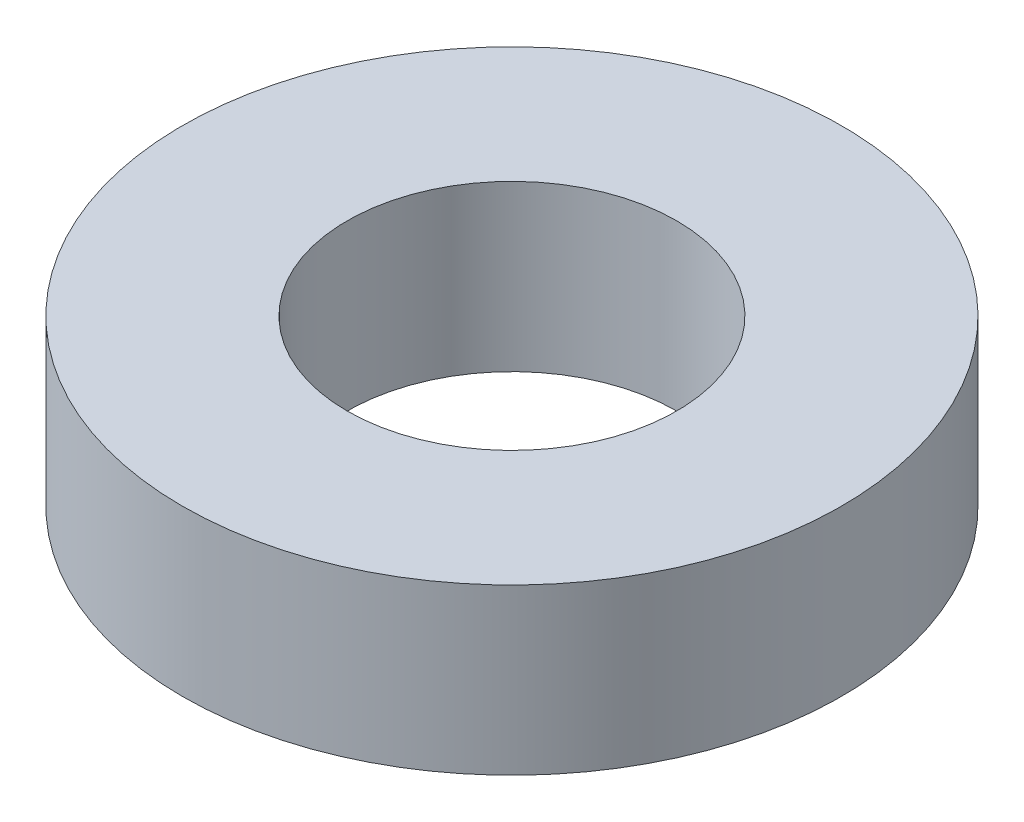
ISO-10303-21;
HEADER;
FILE_DESCRIPTION(('STEP AP214'),'2;1');
FILE_NAME('part.step','',(''),(''),'','','');
FILE_SCHEMA(('AUTOMOTIVE_DESIGN { 1 0 10303 214 1 1 1 1 }'));
ENDSEC;
DATA;
#1=APPLICATION_CONTEXT('core data for automotive mechanical design processes');
#2=APPLICATION_PROTOCOL_DEFINITION('international standard','automotive_design',2000,#1);
#3=PRODUCT_CONTEXT('',#1,'mechanical');
#4=PRODUCT('Part','Part','',(#3));
#5=PRODUCT_RELATED_PRODUCT_CATEGORY('part','',(#4));
#6=PRODUCT_DEFINITION_FORMATION('','',#4);
#7=PRODUCT_DEFINITION_CONTEXT('part definition',#1,'design');
#8=PRODUCT_DEFINITION('design','',#6,#7);
#9=PRODUCT_DEFINITION_SHAPE('','',#8);
#10=(LENGTH_UNIT() NAMED_UNIT(*) SI_UNIT(.MILLI.,.METRE.));
#11=(NAMED_UNIT(*) PLANE_ANGLE_UNIT() SI_UNIT($,.RADIAN.));
#12=(NAMED_UNIT(*) SI_UNIT($,.STERADIAN.) SOLID_ANGLE_UNIT());
#13=UNCERTAINTY_MEASURE_WITH_UNIT(LENGTH_MEASURE(1.E-05),#10,'distance_accuracy_value','');
#14=(GEOMETRIC_REPRESENTATION_CONTEXT(3) GLOBAL_UNCERTAINTY_ASSIGNED_CONTEXT((#13)) GLOBAL_UNIT_ASSIGNED_CONTEXT((#10,
#11,#12)) REPRESENTATION_CONTEXT('',''));
#15=CARTESIAN_POINT('',(0.,0.,0.));
#16=DIRECTION('',(0.,0.,1.));
#17=DIRECTION('',(1.,0.,0.));
#18=AXIS2_PLACEMENT_3D('',#15,#16,#17);
#19=CARTESIAN_POINT('',(0.,2.,0.));
#20=DIRECTION('',(0.,1.,0.));
#21=DIRECTION('',(0.,0.,1.));
#22=AXIS2_PLACEMENT_3D('',#19,#20,#21);
#23=PLANE('',#22);
#24=CARTESIAN_POINT('',(0.,2.,0.));
#25=DIRECTION('',(0.,1.,0.));
#26=DIRECTION('',(0.,0.,1.));
#27=AXIS2_PLACEMENT_3D('',#24,#25,#26);
#28=CIRCLE('',#27,4.);
#29=CARTESIAN_POINT('',(0.,2.,4.));
#30=VERTEX_POINT('',#29);
#31=EDGE_CURVE('E10',#30,#30,#28,.T.);
#32=ORIENTED_EDGE('',*,*,#31,.T.);
#33=EDGE_LOOP('',(#32));
#34=FACE_BOUND('',#33,.T.);
#35=CARTESIAN_POINT('',(0.,2.,0.));
#36=DIRECTION('',(0.,1.,0.));
#37=DIRECTION('',(0.,0.,1.));
#38=AXIS2_PLACEMENT_3D('',#35,#36,#37);
#39=CIRCLE('',#38,2.);
#40=CARTESIAN_POINT('',(0.,2.,2.));
#41=VERTEX_POINT('',#40);
#42=EDGE_CURVE('E46',#41,#41,#39,.T.);
#43=ORIENTED_EDGE('',*,*,#42,.F.);
#44=EDGE_LOOP('',(#43));
#45=FACE_BOUND('',#44,.T.);
#46=ADVANCED_FACE('F35',(#34,#45),#23,.T.);
#47=CARTESIAN_POINT('',(0.,0.,0.));
#48=DIRECTION('',(0.,1.,0.));
#49=DIRECTION('',(0.,0.,1.));
#50=AXIS2_PLACEMENT_3D('',#47,#48,#49);
#51=PLANE('',#50);
#52=CARTESIAN_POINT('',(0.,0.,0.));
#53=DIRECTION('',(0.,1.,0.));
#54=DIRECTION('',(0.,0.,1.));
#55=AXIS2_PLACEMENT_3D('',#52,#53,#54);
#56=CIRCLE('',#55,4.);
#57=CARTESIAN_POINT('',(0.,0.,4.));
#58=VERTEX_POINT('',#57);
#59=EDGE_CURVE('E39',#58,#58,#56,.T.);
#60=ORIENTED_EDGE('',*,*,#59,.F.);
#61=EDGE_LOOP('',(#60));
#62=FACE_BOUND('',#61,.T.);
#63=CARTESIAN_POINT('',(0.,0.,0.));
#64=DIRECTION('',(0.,1.,0.));
#65=DIRECTION('',(0.,0.,1.));
#66=AXIS2_PLACEMENT_3D('',#63,#64,#65);
#67=CIRCLE('',#66,2.);
#68=CARTESIAN_POINT('',(0.,0.,2.));
#69=VERTEX_POINT('',#68);
#70=EDGE_CURVE('E48',#69,#69,#67,.T.);
#71=ORIENTED_EDGE('',*,*,#70,.T.);
#72=EDGE_LOOP('',(#71));
#73=FACE_BOUND('',#72,.T.);
#74=ADVANCED_FACE('F58',(#62,#73),#51,.F.);
#75=CARTESIAN_POINT('',(0.,2.,0.));
#76=DIRECTION('',(0.,-1.,0.));
#77=DIRECTION('',(0.,0.,-1.));
#78=AXIS2_PLACEMENT_3D('',#75,#76,#77);
#79=CYLINDRICAL_SURFACE('',#78,4.);
#80=ORIENTED_EDGE('',*,*,#31,.F.);
#81=EDGE_LOOP('',(#80));
#82=FACE_BOUND('',#81,.T.);
#83=ORIENTED_EDGE('',*,*,#59,.T.);
#84=EDGE_LOOP('',(#83));
#85=FACE_BOUND('',#84,.T.);
#86=ADVANCED_FACE('F37',(#82,#85),#79,.T.);
#87=CARTESIAN_POINT('',(0.,2.,0.));
#88=DIRECTION('',(0.,-1.,0.));
#89=DIRECTION('',(0.,0.,-1.));
#90=AXIS2_PLACEMENT_3D('',#87,#88,#89);
#91=CYLINDRICAL_SURFACE('',#90,2.);
#92=ORIENTED_EDGE('',*,*,#42,.T.);
#93=EDGE_LOOP('',(#92));
#94=FACE_BOUND('',#93,.T.);
#95=ORIENTED_EDGE('',*,*,#70,.F.);
#96=EDGE_LOOP('',(#95));
#97=FACE_BOUND('',#96,.T.);
#98=ADVANCED_FACE('F54',(#94,#97),#91,.F.);
#99=CLOSED_SHELL('',(#46,#74,#86,#98));
#100=MANIFOLD_SOLID_BREP('B2',#99);
#101=ADVANCED_BREP_SHAPE_REPRESENTATION('',(#18,#100),#14);
#102=SHAPE_DEFINITION_REPRESENTATION(#9,#101);
ENDSEC;
END-ISO-10303-21;
